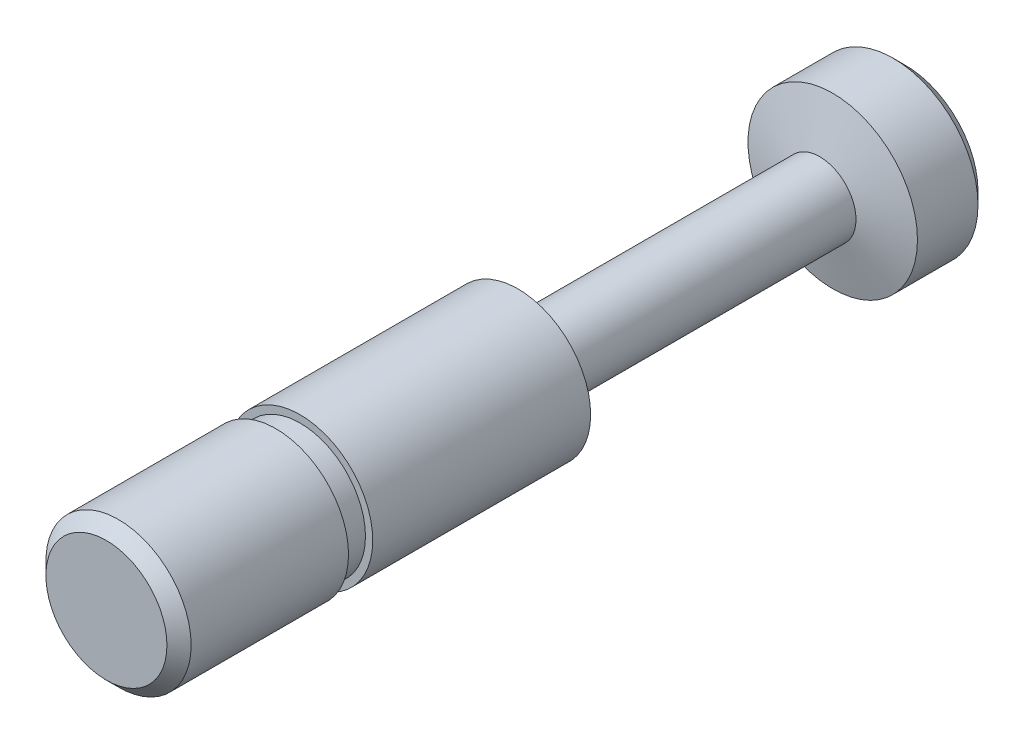
ISO-10303-21;
HEADER;
FILE_DESCRIPTION(('STEP AP214'),'2;1');
FILE_NAME('part.step','',(''),(''),'','','');
FILE_SCHEMA(('AUTOMOTIVE_DESIGN { 1 0 10303 214 1 1 1 1 }'));
ENDSEC;
DATA;
#1=APPLICATION_CONTEXT('core data for automotive mechanical design processes');
#2=APPLICATION_PROTOCOL_DEFINITION('international standard','automotive_design',2000,#1);
#3=PRODUCT_CONTEXT('',#1,'mechanical');
#4=PRODUCT('Part','Part','',(#3));
#5=PRODUCT_RELATED_PRODUCT_CATEGORY('part','',(#4));
#6=PRODUCT_DEFINITION_FORMATION('','',#4);
#7=PRODUCT_DEFINITION_CONTEXT('part definition',#1,'design');
#8=PRODUCT_DEFINITION('design','',#6,#7);
#9=PRODUCT_DEFINITION_SHAPE('','',#8);
#10=(LENGTH_UNIT() NAMED_UNIT(*) SI_UNIT(.MILLI.,.METRE.));
#11=(NAMED_UNIT(*) PLANE_ANGLE_UNIT() SI_UNIT($,.RADIAN.));
#12=(NAMED_UNIT(*) SI_UNIT($,.STERADIAN.) SOLID_ANGLE_UNIT());
#13=UNCERTAINTY_MEASURE_WITH_UNIT(LENGTH_MEASURE(1.E-05),#10,'distance_accuracy_value','');
#14=(GEOMETRIC_REPRESENTATION_CONTEXT(3) GLOBAL_UNCERTAINTY_ASSIGNED_CONTEXT((#13)) GLOBAL_UNIT_ASSIGNED_CONTEXT((#10,
#11,#12)) REPRESENTATION_CONTEXT('',''));
#15=CARTESIAN_POINT('',(0.,0.,0.));
#16=DIRECTION('',(0.,0.,1.));
#17=DIRECTION('',(1.,0.,0.));
#18=AXIS2_PLACEMENT_3D('',#15,#16,#17);
#19=CARTESIAN_POINT('',(0.,0.,-17.87));
#20=DIRECTION('',(0.,0.,1.));
#21=DIRECTION('',(1.,0.,0.));
#22=AXIS2_PLACEMENT_3D('',#19,#20,#21);
#23=CYLINDRICAL_SURFACE('',#22,3.);
#24=CARTESIAN_POINT('',(0.,0.,-17.));
#25=DIRECTION('',(0.,0.,1.));
#26=DIRECTION('',(1.,0.,0.));
#27=AXIS2_PLACEMENT_3D('',#24,#25,#26);
#28=CIRCLE('',#27,3.);
#29=CARTESIAN_POINT('',(3.,0.,-17.));
#30=VERTEX_POINT('',#29);
#31=EDGE_CURVE('E20',#30,#30,#28,.T.);
#32=ORIENTED_EDGE('',*,*,#31,.T.);
#33=EDGE_LOOP('',(#32));
#34=FACE_BOUND('',#33,.T.);
#35=CARTESIAN_POINT('',(0.,0.,-8.));
#36=DIRECTION('',(0.,0.,1.));
#37=DIRECTION('',(1.,0.,0.));
#38=AXIS2_PLACEMENT_3D('',#35,#36,#37);
#39=CIRCLE('',#38,3.);
#40=CARTESIAN_POINT('',(3.,0.,-8.));
#41=VERTEX_POINT('',#40);
#42=EDGE_CURVE('E39',#41,#41,#39,.F.);
#43=ORIENTED_EDGE('',*,*,#42,.T.);
#44=EDGE_LOOP('',(#43));
#45=FACE_BOUND('',#44,.T.);
#46=ADVANCED_FACE('F13',(#34,#45),#23,.T.);
#47=CARTESIAN_POINT('',(0.,0.,-8.));
#48=DIRECTION('',(0.,0.,1.));
#49=DIRECTION('',(1.,0.,0.));
#50=AXIS2_PLACEMENT_3D('',#47,#48,#49);
#51=PLANE('',#50);
#52=ORIENTED_EDGE('',*,*,#42,.F.);
#53=EDGE_LOOP('',(#52));
#54=FACE_BOUND('',#53,.T.);
#55=CARTESIAN_POINT('',(0.,0.,-8.));
#56=DIRECTION('',(0.,0.,1.));
#57=DIRECTION('',(1.,0.,0.));
#58=AXIS2_PLACEMENT_3D('',#55,#56,#57);
#59=CIRCLE('',#58,2.7);
#60=CARTESIAN_POINT('',(2.7,0.,-8.));
#61=VERTEX_POINT('',#60);
#62=EDGE_CURVE('E45',#61,#61,#59,.T.);
#63=ORIENTED_EDGE('',*,*,#62,.F.);
#64=EDGE_LOOP('',(#63));
#65=FACE_BOUND('',#64,.T.);
#66=ADVANCED_FACE('F71',(#54,#65),#51,.T.);
#67=CARTESIAN_POINT('',(0.,0.,-7.));
#68=DIRECTION('',(0.,0.,1.));
#69=DIRECTION('',(1.,0.,0.));
#70=AXIS2_PLACEMENT_3D('',#67,#68,#69);
#71=PLANE('',#70);
#72=CARTESIAN_POINT('',(0.,0.,-7.));
#73=DIRECTION('',(0.,0.,1.));
#74=DIRECTION('',(1.,0.,0.));
#75=AXIS2_PLACEMENT_3D('',#72,#73,#74);
#76=CIRCLE('',#75,3.);
#77=CARTESIAN_POINT('',(3.,0.,-7.));
#78=VERTEX_POINT('',#77);
#79=EDGE_CURVE('E42',#78,#78,#76,.F.);
#80=ORIENTED_EDGE('',*,*,#79,.T.);
#81=EDGE_LOOP('',(#80));
#82=FACE_BOUND('',#81,.T.);
#83=CARTESIAN_POINT('',(0.,0.,-7.));
#84=DIRECTION('',(0.,0.,1.));
#85=DIRECTION('',(1.,0.,0.));
#86=AXIS2_PLACEMENT_3D('',#83,#84,#85);
#87=CIRCLE('',#86,2.7);
#88=CARTESIAN_POINT('',(2.7,0.,-7.));
#89=VERTEX_POINT('',#88);
#90=EDGE_CURVE('E46',#89,#89,#87,.T.);
#91=ORIENTED_EDGE('',*,*,#90,.T.);
#92=EDGE_LOOP('',(#91));
#93=FACE_BOUND('',#92,.T.);
#94=ADVANCED_FACE('F77',(#82,#93),#71,.F.);
#95=CARTESIAN_POINT('',(0.,0.,-8.));
#96=DIRECTION('',(0.,0.,1.));
#97=DIRECTION('',(1.,0.,0.));
#98=AXIS2_PLACEMENT_3D('',#95,#96,#97);
#99=CYLINDRICAL_SURFACE('',#98,2.7);
#100=ORIENTED_EDGE('',*,*,#62,.T.);
#101=EDGE_LOOP('',(#100));
#102=FACE_BOUND('',#101,.T.);
#103=ORIENTED_EDGE('',*,*,#90,.F.);
#104=EDGE_LOOP('',(#103));
#105=FACE_BOUND('',#104,.T.);
#106=ADVANCED_FACE('F92',(#102,#105),#99,.T.);
#107=CARTESIAN_POINT('',(0.,0.,0.));
#108=DIRECTION('',(0.,0.,1.));
#109=DIRECTION('',(1.,0.,0.));
#110=AXIS2_PLACEMENT_3D('',#107,#108,#109);
#111=PLANE('',#110);
#112=CARTESIAN_POINT('',(0.,0.,0.));
#113=DIRECTION('',(0.,0.,1.));
#114=DIRECTION('',(1.,0.,0.));
#115=AXIS2_PLACEMENT_3D('',#112,#113,#114);
#116=CIRCLE('',#115,2.5);
#117=CARTESIAN_POINT('',(2.5,0.,0.));
#118=VERTEX_POINT('',#117);
#119=EDGE_CURVE('E36',#118,#118,#116,.T.);
#120=ORIENTED_EDGE('',*,*,#119,.T.);
#121=EDGE_LOOP('',(#120));
#122=FACE_BOUND('',#121,.T.);
#123=ADVANCED_FACE('F84',(#122),#111,.T.);
#124=CARTESIAN_POINT('',(0.,0.,-0.500000000000004));
#125=DIRECTION('',(0.,0.,1.));
#126=DIRECTION('',(1.,0.,0.));
#127=AXIS2_PLACEMENT_3D('',#124,#125,#126);
#128=CIRCLE('',#127,3.);
#129=CARTESIAN_POINT('',(3.,0.,-0.500000000000004));
#130=VERTEX_POINT('',#129);
#131=EDGE_CURVE('E33',#130,#130,#128,.F.);
#132=ORIENTED_EDGE('',*,*,#131,.T.);
#133=EDGE_LOOP('',(#132));
#134=FACE_BOUND('',#133,.T.);
#135=ORIENTED_EDGE('',*,*,#79,.F.);
#136=EDGE_LOOP('',(#135));
#137=FACE_BOUND('',#136,.T.);
#138=ADVANCED_FACE('F73',(#134,#137),#23,.T.);
#139=CARTESIAN_POINT('',(0.,0.,-29.46));
#140=DIRECTION('',(0.,0.,1.));
#141=DIRECTION('',(1.,0.,0.));
#142=AXIS2_PLACEMENT_3D('',#139,#140,#141);
#143=CYLINDRICAL_SURFACE('',#142,1.5);
#144=CARTESIAN_POINT('',(0.,0.,-29.46));
#145=DIRECTION('',(0.,0.,1.));
#146=DIRECTION('',(1.,0.,0.));
#147=AXIS2_PLACEMENT_3D('',#144,#145,#146);
#148=CIRCLE('',#147,1.5);
#149=CARTESIAN_POINT('',(1.5,0.,-29.46));
#150=VERTEX_POINT('',#149);
#151=EDGE_CURVE('E49',#150,#150,#148,.T.);
#152=ORIENTED_EDGE('',*,*,#151,.T.);
#153=EDGE_LOOP('',(#152));
#154=FACE_BOUND('',#153,.T.);
#155=CARTESIAN_POINT('',(0.,0.,-17.87));
#156=DIRECTION('',(0.,0.,1.));
#157=DIRECTION('',(1.,0.,0.));
#158=AXIS2_PLACEMENT_3D('',#155,#156,#157);
#159=CIRCLE('',#158,1.5);
#160=CARTESIAN_POINT('',(1.5,0.,-17.87));
#161=VERTEX_POINT('',#160);
#162=EDGE_CURVE('E52',#161,#161,#159,.T.);
#163=ORIENTED_EDGE('',*,*,#162,.F.);
#164=EDGE_LOOP('',(#163));
#165=FACE_BOUND('',#164,.T.);
#166=ADVANCED_FACE('F58',(#154,#165),#143,.T.);
#167=CARTESIAN_POINT('',(0.,0.,-33.));
#168=DIRECTION('',(0.,0.,1.));
#169=DIRECTION('',(1.,0.,0.));
#170=AXIS2_PLACEMENT_3D('',#167,#168,#169);
#171=PLANE('',#170);
#172=CARTESIAN_POINT('',(0.,0.,-33.));
#173=DIRECTION('',(0.,0.,1.));
#174=DIRECTION('',(1.,0.,0.));
#175=AXIS2_PLACEMENT_3D('',#172,#173,#174);
#176=CIRCLE('',#175,3.00000000000001);
#177=CARTESIAN_POINT('',(3.00000000000001,0.,-33.));
#178=VERTEX_POINT('',#177);
#179=EDGE_CURVE('E24',#178,#178,#176,.F.);
#180=ORIENTED_EDGE('',*,*,#179,.T.);
#181=EDGE_LOOP('',(#180));
#182=FACE_BOUND('',#181,.T.);
#183=ADVANCED_FACE('F90',(#182),#171,.F.);
#184=CARTESIAN_POINT('',(0.,0.,-33.));
#185=DIRECTION('',(0.,0.,1.));
#186=DIRECTION('',(1.,0.,0.));
#187=AXIS2_PLACEMENT_3D('',#184,#185,#186);
#188=CYLINDRICAL_SURFACE('',#187,3.5);
#189=CARTESIAN_POINT('',(0.,0.,-30.));
#190=DIRECTION('',(0.,0.,1.));
#191=DIRECTION('',(1.,0.,0.));
#192=AXIS2_PLACEMENT_3D('',#189,#190,#191);
#193=CIRCLE('',#192,3.5);
#194=CARTESIAN_POINT('',(3.5,0.,-30.));
#195=VERTEX_POINT('',#194);
#196=EDGE_CURVE('E9',#195,#195,#193,.F.);
#197=ORIENTED_EDGE('',*,*,#196,.T.);
#198=EDGE_LOOP('',(#197));
#199=FACE_BOUND('',#198,.T.);
#200=CARTESIAN_POINT('',(0.,0.,-32.5));
#201=DIRECTION('',(0.,0.,1.));
#202=DIRECTION('',(1.,0.,0.));
#203=AXIS2_PLACEMENT_3D('',#200,#201,#202);
#204=CIRCLE('',#203,3.5);
#205=CARTESIAN_POINT('',(3.5,0.,-32.5));
#206=VERTEX_POINT('',#205);
#207=EDGE_CURVE('E28',#206,#206,#204,.T.);
#208=ORIENTED_EDGE('',*,*,#207,.T.);
#209=EDGE_LOOP('',(#208));
#210=FACE_BOUND('',#209,.T.);
#211=ADVANCED_FACE('F144',(#199,#210),#188,.T.);
#212=CARTESIAN_POINT('',(0.,0.,0.));
#213=DIRECTION('',(0.,0.,-1.));
#214=DIRECTION('',(-1.,0.,0.));
#215=AXIS2_PLACEMENT_3D('',#212,#213,#214);
#216=CONICAL_SURFACE('',#215,2.5,0.78539816339745);
#217=ORIENTED_EDGE('',*,*,#131,.F.);
#218=EDGE_LOOP('',(#217));
#219=FACE_BOUND('',#218,.T.);
#220=ORIENTED_EDGE('',*,*,#119,.F.);
#221=EDGE_LOOP('',(#220));
#222=FACE_BOUND('',#221,.T.);
#223=ADVANCED_FACE('F154',(#219,#222),#216,.T.);
#224=CARTESIAN_POINT('',(0.,0.,-32.5));
#225=DIRECTION('',(0.,0.,1.));
#226=DIRECTION('',(1.,0.,0.));
#227=AXIS2_PLACEMENT_3D('',#224,#225,#226);
#228=CONICAL_SURFACE('',#227,3.5,0.785398163397442);
#229=ORIENTED_EDGE('',*,*,#179,.F.);
#230=EDGE_LOOP('',(#229));
#231=FACE_BOUND('',#230,.T.);
#232=ORIENTED_EDGE('',*,*,#207,.F.);
#233=EDGE_LOOP('',(#232));
#234=FACE_BOUND('',#233,.T.);
#235=ADVANCED_FACE('F68',(#231,#234),#228,.T.);
#236=CARTESIAN_POINT('',(0.,0.,-17.87));
#237=DIRECTION('',(0.,0.,1.));
#238=DIRECTION('',(1.,0.,0.));
#239=AXIS2_PLACEMENT_3D('',#236,#237,#238);
#240=CONICAL_SURFACE('',#239,1.49999999999999,1.04521253324329);
#241=ORIENTED_EDGE('',*,*,#31,.F.);
#242=EDGE_LOOP('',(#241));
#243=FACE_BOUND('',#242,.T.);
#244=ORIENTED_EDGE('',*,*,#162,.T.);
#245=EDGE_LOOP('',(#244));
#246=FACE_BOUND('',#245,.T.);
#247=ADVANCED_FACE('F62',(#243,#246),#240,.T.);
#248=CARTESIAN_POINT('',(0.,0.,-29.46));
#249=DIRECTION('',(0.,0.,-1.));
#250=DIRECTION('',(-1.,0.,0.));
#251=AXIS2_PLACEMENT_3D('',#248,#249,#250);
#252=CONICAL_SURFACE('',#251,1.49999999999996,1.30708449233263);
#253=ORIENTED_EDGE('',*,*,#196,.F.);
#254=EDGE_LOOP('',(#253));
#255=FACE_BOUND('',#254,.T.);
#256=ORIENTED_EDGE('',*,*,#151,.F.);
#257=EDGE_LOOP('',(#256));
#258=FACE_BOUND('',#257,.T.);
#259=ADVANCED_FACE('F15',(#255,#258),#252,.T.);
#260=CLOSED_SHELL('',(#46,#66,#94,#106,#123,#138,#166,#183,#211,#223,#235,#247,#259));
#261=MANIFOLD_SOLID_BREP('B1',#260);
#262=ADVANCED_BREP_SHAPE_REPRESENTATION('',(#18,#261),#14);
#263=SHAPE_DEFINITION_REPRESENTATION(#9,#262);
ENDSEC;
END-ISO-10303-21;
